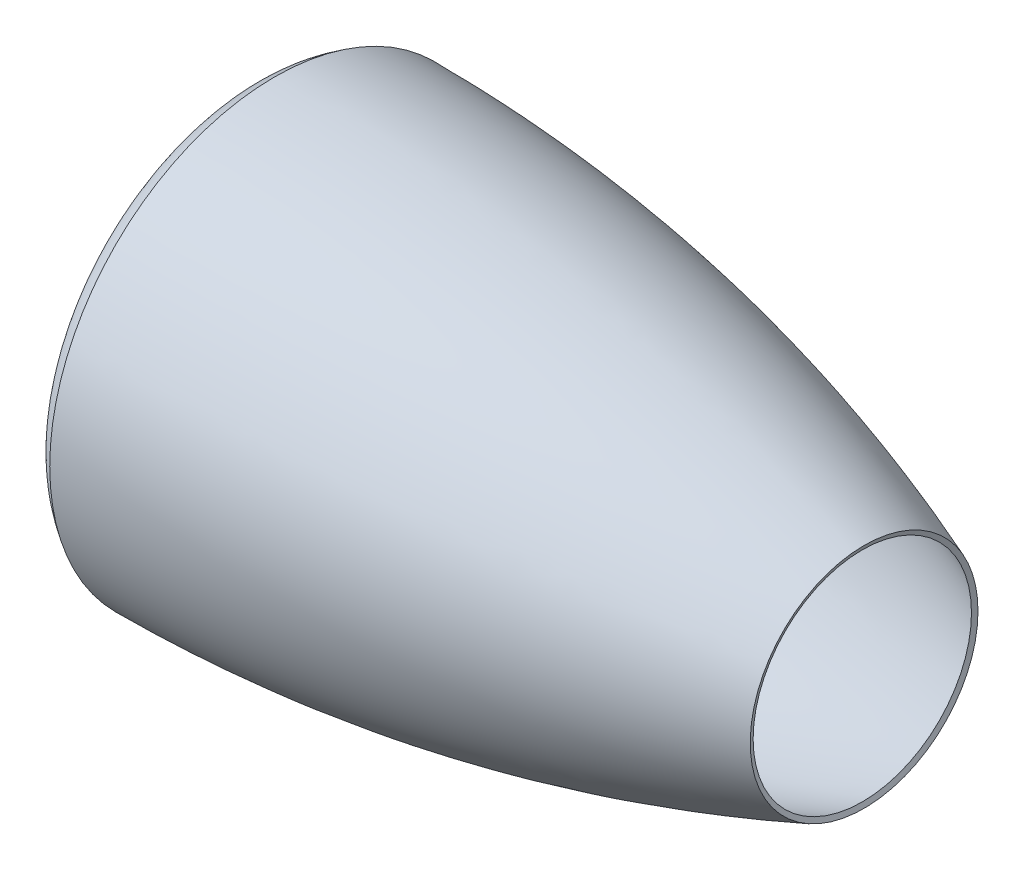
ISO-10303-21;
HEADER;
FILE_DESCRIPTION(('STEP AP214'),'2;1');
FILE_NAME('part.step','',(''),(''),'','','');
FILE_SCHEMA(('AUTOMOTIVE_DESIGN { 1 0 10303 214 1 1 1 1 }'));
ENDSEC;
DATA;
#1=APPLICATION_CONTEXT('core data for automotive mechanical design processes');
#2=APPLICATION_PROTOCOL_DEFINITION('international standard','automotive_design',2000,#1);
#3=PRODUCT_CONTEXT('',#1,'mechanical');
#4=PRODUCT('Part','Part','',(#3));
#5=PRODUCT_RELATED_PRODUCT_CATEGORY('part','',(#4));
#6=PRODUCT_DEFINITION_FORMATION('','',#4);
#7=PRODUCT_DEFINITION_CONTEXT('part definition',#1,'design');
#8=PRODUCT_DEFINITION('design','',#6,#7);
#9=PRODUCT_DEFINITION_SHAPE('','',#8);
#10=(LENGTH_UNIT() NAMED_UNIT(*) SI_UNIT(.MILLI.,.METRE.));
#11=(NAMED_UNIT(*) PLANE_ANGLE_UNIT() SI_UNIT($,.RADIAN.));
#12=(NAMED_UNIT(*) SI_UNIT($,.STERADIAN.) SOLID_ANGLE_UNIT());
#13=UNCERTAINTY_MEASURE_WITH_UNIT(LENGTH_MEASURE(1.E-05),#10,'distance_accuracy_value','');
#14=(GEOMETRIC_REPRESENTATION_CONTEXT(3) GLOBAL_UNCERTAINTY_ASSIGNED_CONTEXT((#13)) GLOBAL_UNIT_ASSIGNED_CONTEXT((#10,
#11,#12)) REPRESENTATION_CONTEXT('',''));
#15=CARTESIAN_POINT('',(0.,0.,0.));
#16=DIRECTION('',(0.,0.,1.));
#17=DIRECTION('',(1.,0.,0.));
#18=AXIS2_PLACEMENT_3D('',#15,#16,#17);
#19=CARTESIAN_POINT('',(65.9797287669947,0.,0.));
#20=DIRECTION('',(-1.,0.,0.));
#21=DIRECTION('',(0.,0.,1.));
#22=AXIS2_PLACEMENT_3D('',#19,#20,#21);
#23=PLANE('',#22);
#24=CARTESIAN_POINT('',(65.9797287669947,0.,0.));
#25=DIRECTION('',(1.,0.,0.));
#26=DIRECTION('',(0.,0.,-1.));
#27=AXIS2_PLACEMENT_3D('',#24,#25,#26);
#28=CIRCLE('',#27,185.);
#29=CARTESIAN_POINT('',(65.9797287669947,0.,-185.));
#30=VERTEX_POINT('',#29);
#31=EDGE_CURVE('E51',#30,#30,#28,.T.);
#32=ORIENTED_EDGE('',*,*,#31,.F.);
#33=EDGE_LOOP('',(#32));
#34=FACE_BOUND('',#33,.T.);
#35=CARTESIAN_POINT('',(65.9797287669947,0.,0.));
#36=DIRECTION('',(1.,0.,0.));
#37=DIRECTION('',(0.,0.,-1.));
#38=AXIS2_PLACEMENT_3D('',#35,#36,#37);
#39=CIRCLE('',#38,190.);
#40=CARTESIAN_POINT('',(65.9797287669947,0.,-190.));
#41=VERTEX_POINT('',#40);
#42=EDGE_CURVE('E117',#41,#41,#39,.T.);
#43=ORIENTED_EDGE('',*,*,#42,.T.);
#44=EDGE_LOOP('',(#43));
#45=FACE_BOUND('',#44,.T.);
#46=ADVANCED_FACE('F33',(#34,#45),#23,.F.);
#47=CARTESIAN_POINT('',(580.,0.,0.));
#48=DIRECTION('',(1.,0.,0.));
#49=DIRECTION('',(0.,0.,-1.));
#50=AXIS2_PLACEMENT_3D('',#47,#48,#49);
#51=CONICAL_SURFACE('',#50,108.,1.20335632709353);
#52=CARTESIAN_POINT('',(581.796137456738,0.,0.));
#53=DIRECTION('',(1.,0.,0.));
#54=DIRECTION('',(0.,1.,0.));
#55=AXIS2_PLACEMENT_3D('',#52,#53,#54);
#56=CIRCLE('',#55,112.666250125797);
#57=CARTESIAN_POINT('',(581.796137456738,112.666250125797,0.));
#58=VERTEX_POINT('',#57);
#59=EDGE_CURVE('E10',#58,#58,#56,.T.);
#60=ORIENTED_EDGE('',*,*,#59,.T.);
#61=EDGE_LOOP('',(#60));
#62=FACE_BOUND('',#61,.T.);
#63=CARTESIAN_POINT('',(580.,0.,0.));
#64=DIRECTION('',(1.,0.,0.));
#65=DIRECTION('',(0.,0.,-1.));
#66=AXIS2_PLACEMENT_3D('',#63,#64,#65);
#67=CIRCLE('',#66,108.);
#68=CARTESIAN_POINT('',(580.,0.,-108.));
#69=VERTEX_POINT('',#68);
#70=EDGE_CURVE('E131',#69,#69,#67,.T.);
#71=ORIENTED_EDGE('',*,*,#70,.F.);
#72=EDGE_LOOP('',(#71));
#73=FACE_BOUND('',#72,.T.);
#74=ADVANCED_FACE('F144',(#62,#73),#51,.F.);
#75=CARTESIAN_POINT('',(580.,108.,0.));
#76=CARTESIAN_POINT('',(298.18847424374,216.475161747779,0.));
#77=CARTESIAN_POINT('',(-2.98188474243742,217.489558378198,0.));
#78=CARTESIAN_POINT('',(-5.96376948487482,217.499601909193,0.));
#79=B_SPLINE_CURVE_WITH_KNOTS('',2,(#75,#76,#77,#78),.UNSPECIFIED.,.F.,.F.,(3,1,3),(0.,1.,1.01),.UNSPECIFIED.);
#80=CARTESIAN_POINT('',(0.,0.,0.));
#81=DIRECTION('',(1.,0.,0.));
#82=AXIS1_PLACEMENT('',#80,#81);
#83=SURFACE_OF_REVOLUTION('',#79,#82);
#84=OFFSET_SURFACE('',#83,-5.,.F.);
#85=CARTESIAN_POINT('',(-1.38305959164028,0.,0.));
#86=DIRECTION('',(1.,0.,0.));
#87=DIRECTION('',(0.,0.,-1.));
#88=AXIS2_PLACEMENT_3D('',#85,#86,#87);
#89=CIRCLE('',#88,222.484201605395);
#90=CARTESIAN_POINT('',(-1.38305959164028,0.,-222.484201605395));
#91=VERTEX_POINT('',#90);
#92=EDGE_CURVE('E40',#91,#91,#89,.T.);
#93=ORIENTED_EDGE('',*,*,#92,.T.);
#94=EDGE_LOOP('',(#93));
#95=FACE_BOUND('',#94,.T.);
#96=ORIENTED_EDGE('',*,*,#59,.F.);
#97=EDGE_LOOP('',(#96));
#98=FACE_BOUND('',#97,.T.);
#99=ADVANCED_FACE('F70',(#95,#98),#84,.F.);
#100=CARTESIAN_POINT('',(1.19882713683698,218.202395803947,0.));
#101=CARTESIAN_POINT('',(0.599413568418483,217.840955325576,0.));
#102=CARTESIAN_POINT('',(-35.4220135694005,196.120389522125,0.));
#103=CARTESIAN_POINT('',(0.493424869735633,179.775444693892,0.));
#104=CARTESIAN_POINT('',(0.986849739471267,179.550889387784,0.));
#105=B_SPLINE_CURVE_WITH_KNOTS('',2,(#100,#101,#102,#103,#104),.UNSPECIFIED.,.F.,.F.,(3,1,1,3),
(-0.0169220636552492,0.,1.,1.01392989330685),.UNSPECIFIED.);
#106=CARTESIAN_POINT('',(0.,0.,0.));
#107=DIRECTION('',(1.,0.,0.));
#108=AXIS1_PLACEMENT('',#106,#107);
#109=SURFACE_OF_REVOLUTION('',#105,#108);
#110=OFFSET_SURFACE('',#109,-5.,.F.);
#111=CARTESIAN_POINT('',(-1.08423832726003,0.,0.));
#112=DIRECTION('',(1.,0.,0.));
#113=DIRECTION('',(0.,0.,-1.));
#114=AXIS2_PLACEMENT_3D('',#111,#112,#113);
#115=CIRCLE('',#114,175.);
#116=CARTESIAN_POINT('',(-1.08423832726003,0.,-175.));
#117=VERTEX_POINT('',#116);
#118=EDGE_CURVE('E45',#117,#117,#115,.T.);
#119=ORIENTED_EDGE('',*,*,#118,.T.);
#120=EDGE_LOOP('',(#119));
#121=FACE_BOUND('',#120,.T.);
#122=ORIENTED_EDGE('',*,*,#92,.F.);
#123=EDGE_LOOP('',(#122));
#124=FACE_BOUND('',#123,.T.);
#125=ADVANCED_FACE('F71',(#121,#124),#110,.F.);
#126=CARTESIAN_POINT('',(0.,0.,0.));
#127=DIRECTION('',(1.,0.,0.));
#128=DIRECTION('',(0.,0.,-1.));
#129=AXIS2_PLACEMENT_3D('',#126,#127,#128);
#130=CYLINDRICAL_SURFACE('',#129,175.);
#131=CARTESIAN_POINT('',(26.4355232937645,0.,0.));
#132=DIRECTION('',(1.,0.,0.));
#133=DIRECTION('',(0.,0.,-1.));
#134=AXIS2_PLACEMENT_3D('',#131,#132,#133);
#135=CIRCLE('',#134,175.);
#136=CARTESIAN_POINT('',(26.4355232937645,0.,-175.));
#137=VERTEX_POINT('',#136);
#138=EDGE_CURVE('E54',#137,#137,#135,.T.);
#139=ORIENTED_EDGE('',*,*,#138,.T.);
#140=EDGE_LOOP('',(#139));
#141=FACE_BOUND('',#140,.T.);
#142=ORIENTED_EDGE('',*,*,#118,.F.);
#143=EDGE_LOOP('',(#142));
#144=FACE_BOUND('',#143,.T.);
#145=ADVANCED_FACE('F74',(#141,#144),#130,.F.);
#146=CARTESIAN_POINT('',(27.6524107926416,0.,0.));
#147=DIRECTION('',(1.,0.,0.));
#148=DIRECTION('',(0.,0.,-1.));
#149=AXIS2_PLACEMENT_3D('',#146,#147,#148);
#150=CONICAL_SURFACE('',#149,175.761519495494,0.559169251188904);
#151=CARTESIAN_POINT('',(42.4152520607592,0.,0.));
#152=DIRECTION('',(1.,0.,0.));
#153=DIRECTION('',(0.,0.,-1.));
#154=AXIS2_PLACEMENT_3D('',#151,#152,#153);
#155=CIRCLE('',#154,185.);
#156=CARTESIAN_POINT('',(42.4152520607592,0.,-185.));
#157=VERTEX_POINT('',#156);
#158=EDGE_CURVE('E49',#157,#157,#155,.T.);
#159=ORIENTED_EDGE('',*,*,#158,.T.);
#160=EDGE_LOOP('',(#159));
#161=FACE_BOUND('',#160,.T.);
#162=ORIENTED_EDGE('',*,*,#138,.F.);
#163=EDGE_LOOP('',(#162));
#164=FACE_BOUND('',#163,.T.);
#165=ADVANCED_FACE('F80',(#161,#164),#150,.F.);
#166=CARTESIAN_POINT('',(0.,0.,0.));
#167=DIRECTION('',(1.,0.,0.));
#168=DIRECTION('',(0.,0.,-1.));
#169=AXIS2_PLACEMENT_3D('',#166,#167,#168);
#170=CYLINDRICAL_SURFACE('',#169,185.);
#171=ORIENTED_EDGE('',*,*,#31,.T.);
#172=EDGE_LOOP('',(#171));
#173=FACE_BOUND('',#172,.T.);
#174=ORIENTED_EDGE('',*,*,#158,.F.);
#175=EDGE_LOOP('',(#174));
#176=FACE_BOUND('',#175,.T.);
#177=ADVANCED_FACE('F84',(#173,#176),#170,.F.);
#178=CARTESIAN_POINT('',(580.,108.,0.));
#179=CARTESIAN_POINT('',(298.18847424374,216.475161747779,0.));
#180=CARTESIAN_POINT('',(0.,217.479514847204,0.));
#181=B_SPLINE_CURVE_WITH_KNOTS('',2,(#178,#179,#180),.UNSPECIFIED.,.F.,.F.,(3,3),(0.,1.),.UNSPECIFIED.);
#182=CARTESIAN_POINT('',(0.,0.,0.));
#183=DIRECTION('',(1.,0.,0.));
#184=AXIS1_PLACEMENT('',#182,#183);
#185=SURFACE_OF_REVOLUTION('',#181,#184);
#186=CARTESIAN_POINT('',(0.,0.,0.));
#187=DIRECTION('',(1.,0.,0.));
#188=DIRECTION('',(0.,0.,-1.));
#189=AXIS2_PLACEMENT_3D('',#186,#187,#188);
#190=CIRCLE('',#189,217.479514847204);
#191=CARTESIAN_POINT('',(0.,0.,-217.479514847204));
#192=VERTEX_POINT('',#191);
#193=EDGE_CURVE('E36',#192,#192,#190,.T.);
#194=ORIENTED_EDGE('',*,*,#193,.F.);
#195=EDGE_LOOP('',(#194));
#196=FACE_BOUND('',#195,.T.);
#197=ORIENTED_EDGE('',*,*,#70,.T.);
#198=EDGE_LOOP('',(#197));
#199=FACE_BOUND('',#198,.T.);
#200=ADVANCED_FACE('F88',(#196,#199),#185,.T.);
#201=CARTESIAN_POINT('',(0.,217.479514847204,0.));
#202=CARTESIAN_POINT('',(-35.4220135694005,196.120389522125,0.));
#203=CARTESIAN_POINT('',(0.,180.,0.));
#204=B_SPLINE_CURVE_WITH_KNOTS('',2,(#201,#202,#203),.UNSPECIFIED.,.F.,.F.,(3,3),(0.,1.),.UNSPECIFIED.);
#205=CARTESIAN_POINT('',(0.,0.,0.));
#206=DIRECTION('',(1.,0.,0.));
#207=AXIS1_PLACEMENT('',#205,#206);
#208=SURFACE_OF_REVOLUTION('',#204,#207);
#209=CARTESIAN_POINT('',(0.,0.,0.));
#210=DIRECTION('',(1.,0.,0.));
#211=DIRECTION('',(0.,0.,-1.));
#212=AXIS2_PLACEMENT_3D('',#209,#210,#211);
#213=CIRCLE('',#212,180.);
#214=CARTESIAN_POINT('',(0.,0.,-180.));
#215=VERTEX_POINT('',#214);
#216=EDGE_CURVE('E129',#215,#215,#213,.T.);
#217=ORIENTED_EDGE('',*,*,#216,.F.);
#218=EDGE_LOOP('',(#217));
#219=FACE_BOUND('',#218,.T.);
#220=ORIENTED_EDGE('',*,*,#193,.T.);
#221=EDGE_LOOP('',(#220));
#222=FACE_BOUND('',#221,.T.);
#223=ADVANCED_FACE('F101',(#219,#222),#208,.T.);
#224=CARTESIAN_POINT('',(0.,0.,0.));
#225=DIRECTION('',(1.,0.,0.));
#226=DIRECTION('',(0.,0.,-1.));
#227=AXIS2_PLACEMENT_3D('',#224,#225,#226);
#228=CYLINDRICAL_SURFACE('',#227,180.);
#229=CARTESIAN_POINT('',(25.,0.,0.));
#230=DIRECTION('',(1.,0.,0.));
#231=DIRECTION('',(0.,0.,-1.));
#232=AXIS2_PLACEMENT_3D('',#229,#230,#231);
#233=CIRCLE('',#232,180.);
#234=CARTESIAN_POINT('',(25.,0.,-180.));
#235=VERTEX_POINT('',#234);
#236=EDGE_CURVE('E123',#235,#235,#233,.T.);
#237=ORIENTED_EDGE('',*,*,#236,.F.);
#238=EDGE_LOOP('',(#237));
#239=FACE_BOUND('',#238,.T.);
#240=ORIENTED_EDGE('',*,*,#216,.T.);
#241=EDGE_LOOP('',(#240));
#242=FACE_BOUND('',#241,.T.);
#243=ADVANCED_FACE('F97',(#239,#242),#228,.T.);
#244=CARTESIAN_POINT('',(25.,0.,0.));
#245=DIRECTION('',(1.,0.,0.));
#246=DIRECTION('',(0.,0.,-1.));
#247=AXIS2_PLACEMENT_3D('',#244,#245,#246);
#248=CONICAL_SURFACE('',#247,180.,0.559169251188904);
#249=CARTESIAN_POINT('',(40.9797287669947,0.,0.));
#250=DIRECTION('',(1.,0.,0.));
#251=DIRECTION('',(0.,0.,-1.));
#252=AXIS2_PLACEMENT_3D('',#249,#250,#251);
#253=CIRCLE('',#252,190.);
#254=CARTESIAN_POINT('',(40.9797287669947,0.,-190.));
#255=VERTEX_POINT('',#254);
#256=EDGE_CURVE('E124',#255,#255,#253,.T.);
#257=ORIENTED_EDGE('',*,*,#256,.F.);
#258=EDGE_LOOP('',(#257));
#259=FACE_BOUND('',#258,.T.);
#260=ORIENTED_EDGE('',*,*,#236,.T.);
#261=EDGE_LOOP('',(#260));
#262=FACE_BOUND('',#261,.T.);
#263=ADVANCED_FACE('F93',(#259,#262),#248,.T.);
#264=CARTESIAN_POINT('',(0.,0.,0.));
#265=DIRECTION('',(1.,0.,0.));
#266=DIRECTION('',(0.,0.,-1.));
#267=AXIS2_PLACEMENT_3D('',#264,#265,#266);
#268=CYLINDRICAL_SURFACE('',#267,190.);
#269=ORIENTED_EDGE('',*,*,#42,.F.);
#270=EDGE_LOOP('',(#269));
#271=FACE_BOUND('',#270,.T.);
#272=ORIENTED_EDGE('',*,*,#256,.T.);
#273=EDGE_LOOP('',(#272));
#274=FACE_BOUND('',#273,.T.);
#275=ADVANCED_FACE('F90',(#271,#274),#268,.T.);
#276=CLOSED_SHELL('',(#46,#74,#99,#125,#145,#165,#177,#200,#223,#243,#263,#275));
#277=MANIFOLD_SOLID_BREP('B2',#276);
#278=ADVANCED_BREP_SHAPE_REPRESENTATION('',(#18,#277),#14);
#279=SHAPE_DEFINITION_REPRESENTATION(#9,#278);
ENDSEC;
END-ISO-10303-21;
